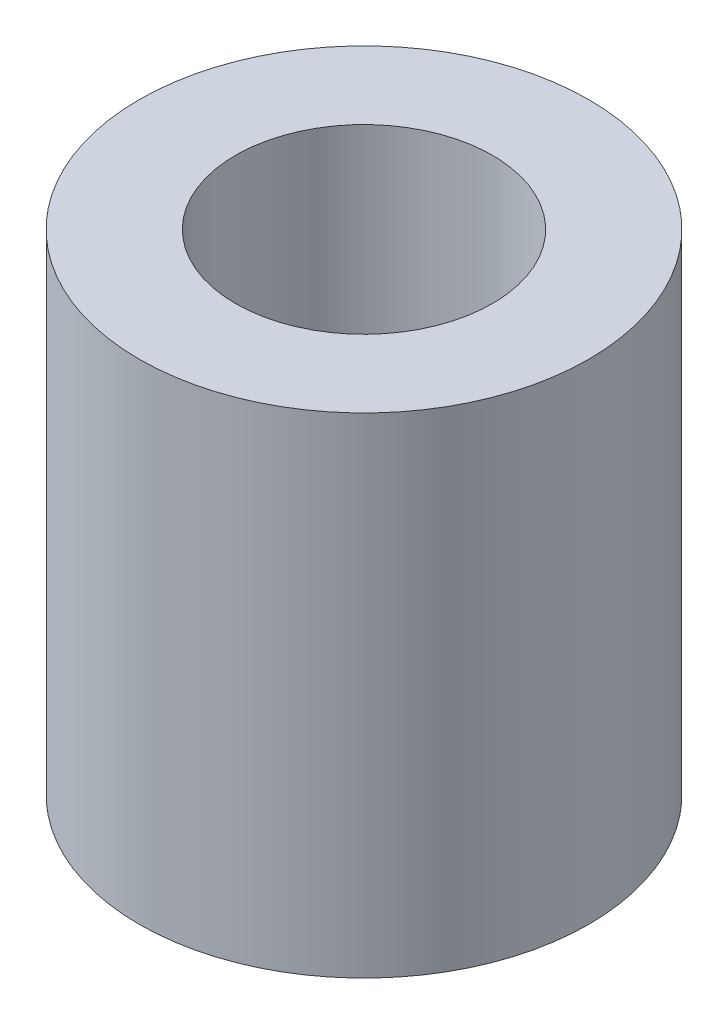
ISO-10303-21;
HEADER;
FILE_DESCRIPTION(('STEP AP214'),'2;1');
FILE_NAME('part.step','',(''),(''),'','','');
FILE_SCHEMA(('AUTOMOTIVE_DESIGN { 1 0 10303 214 1 1 1 1 }'));
ENDSEC;
DATA;
#1=APPLICATION_CONTEXT('core data for automotive mechanical design processes');
#2=APPLICATION_PROTOCOL_DEFINITION('international standard','automotive_design',2000,#1);
#3=PRODUCT_CONTEXT('',#1,'mechanical');
#4=PRODUCT('Part','Part','',(#3));
#5=PRODUCT_RELATED_PRODUCT_CATEGORY('part','',(#4));
#6=PRODUCT_DEFINITION_FORMATION('','',#4);
#7=PRODUCT_DEFINITION_CONTEXT('part definition',#1,'design');
#8=PRODUCT_DEFINITION('design','',#6,#7);
#9=PRODUCT_DEFINITION_SHAPE('','',#8);
#10=(LENGTH_UNIT() NAMED_UNIT(*) SI_UNIT(.MILLI.,.METRE.));
#11=(NAMED_UNIT(*) PLANE_ANGLE_UNIT() SI_UNIT($,.RADIAN.));
#12=(NAMED_UNIT(*) SI_UNIT($,.STERADIAN.) SOLID_ANGLE_UNIT());
#13=UNCERTAINTY_MEASURE_WITH_UNIT(LENGTH_MEASURE(1.E-05),#10,'distance_accuracy_value','');
#14=(GEOMETRIC_REPRESENTATION_CONTEXT(3) GLOBAL_UNCERTAINTY_ASSIGNED_CONTEXT((#13)) GLOBAL_UNIT_ASSIGNED_CONTEXT((#10,
#11,#12)) REPRESENTATION_CONTEXT('',''));
#15=CARTESIAN_POINT('',(0.,0.,0.));
#16=DIRECTION('',(0.,0.,1.));
#17=DIRECTION('',(1.,0.,0.));
#18=AXIS2_PLACEMENT_3D('',#15,#16,#17);
#19=CARTESIAN_POINT('',(0.,-7.62,0.));
#20=DIRECTION('',(0.,1.,0.));
#21=DIRECTION('',(0.,0.,1.));
#22=AXIS2_PLACEMENT_3D('',#19,#20,#21);
#23=CYLINDRICAL_SURFACE('',#22,3.5);
#24=CARTESIAN_POINT('',(0.,-7.62,0.));
#25=DIRECTION('',(0.,1.,0.));
#26=DIRECTION('',(0.,0.,1.));
#27=AXIS2_PLACEMENT_3D('',#24,#25,#26);
#28=CIRCLE('',#27,3.5);
#29=CARTESIAN_POINT('',(0.,-7.62,3.5));
#30=VERTEX_POINT('',#29);
#31=EDGE_CURVE('E10',#30,#30,#28,.T.);
#32=ORIENTED_EDGE('',*,*,#31,.T.);
#33=EDGE_LOOP('',(#32));
#34=FACE_BOUND('',#33,.T.);
#35=CARTESIAN_POINT('',(0.,0.,0.));
#36=DIRECTION('',(0.,1.,0.));
#37=DIRECTION('',(0.,0.,1.));
#38=AXIS2_PLACEMENT_3D('',#35,#36,#37);
#39=CIRCLE('',#38,3.5);
#40=CARTESIAN_POINT('',(0.,0.,3.5));
#41=VERTEX_POINT('',#40);
#42=EDGE_CURVE('E40',#41,#41,#39,.T.);
#43=ORIENTED_EDGE('',*,*,#42,.F.);
#44=EDGE_LOOP('',(#43));
#45=FACE_BOUND('',#44,.T.);
#46=ADVANCED_FACE('F37',(#34,#45),#23,.T.);
#47=CARTESIAN_POINT('',(0.,-7.62,0.));
#48=DIRECTION('',(0.,1.,0.));
#49=DIRECTION('',(0.,0.,1.));
#50=AXIS2_PLACEMENT_3D('',#47,#48,#49);
#51=PLANE('',#50);
#52=CARTESIAN_POINT('',(0.,-7.62,0.));
#53=DIRECTION('',(0.,1.,0.));
#54=DIRECTION('',(0.,0.,1.));
#55=AXIS2_PLACEMENT_3D('',#52,#53,#54);
#56=CIRCLE('',#55,1.999996);
#57=CARTESIAN_POINT('',(0.,-7.62,1.999996));
#58=VERTEX_POINT('',#57);
#59=EDGE_CURVE('E49',#58,#58,#56,.T.);
#60=ORIENTED_EDGE('',*,*,#59,.T.);
#61=EDGE_LOOP('',(#60));
#62=FACE_BOUND('',#61,.T.);
#63=ORIENTED_EDGE('',*,*,#31,.F.);
#64=EDGE_LOOP('',(#63));
#65=FACE_BOUND('',#64,.T.);
#66=ADVANCED_FACE('F59',(#62,#65),#51,.F.);
#67=CARTESIAN_POINT('',(0.,0.,0.));
#68=DIRECTION('',(0.,1.,0.));
#69=DIRECTION('',(0.,0.,1.));
#70=AXIS2_PLACEMENT_3D('',#67,#68,#69);
#71=PLANE('',#70);
#72=CARTESIAN_POINT('',(0.,0.,0.));
#73=DIRECTION('',(0.,1.,0.));
#74=DIRECTION('',(0.,0.,1.));
#75=AXIS2_PLACEMENT_3D('',#72,#73,#74);
#76=CIRCLE('',#75,1.999996);
#77=CARTESIAN_POINT('',(0.,0.,1.999996));
#78=VERTEX_POINT('',#77);
#79=EDGE_CURVE('E51',#78,#78,#76,.T.);
#80=ORIENTED_EDGE('',*,*,#79,.F.);
#81=EDGE_LOOP('',(#80));
#82=FACE_BOUND('',#81,.T.);
#83=ORIENTED_EDGE('',*,*,#42,.T.);
#84=EDGE_LOOP('',(#83));
#85=FACE_BOUND('',#84,.T.);
#86=ADVANCED_FACE('F65',(#82,#85),#71,.T.);
#87=CARTESIAN_POINT('',(0.,-7.62,0.));
#88=DIRECTION('',(0.,1.,0.));
#89=DIRECTION('',(0.,0.,1.));
#90=AXIS2_PLACEMENT_3D('',#87,#88,#89);
#91=CYLINDRICAL_SURFACE('',#90,1.999996);
#92=ORIENTED_EDGE('',*,*,#59,.F.);
#93=EDGE_LOOP('',(#92));
#94=FACE_BOUND('',#93,.T.);
#95=ORIENTED_EDGE('',*,*,#79,.T.);
#96=EDGE_LOOP('',(#95));
#97=FACE_BOUND('',#96,.T.);
#98=ADVANCED_FACE('F62',(#94,#97),#91,.F.);
#99=CLOSED_SHELL('',(#46,#66,#86,#98));
#100=MANIFOLD_SOLID_BREP('B2',#99);
#101=ADVANCED_BREP_SHAPE_REPRESENTATION('',(#18,#100),#14);
#102=SHAPE_DEFINITION_REPRESENTATION(#9,#101);
ENDSEC;
END-ISO-10303-21;
